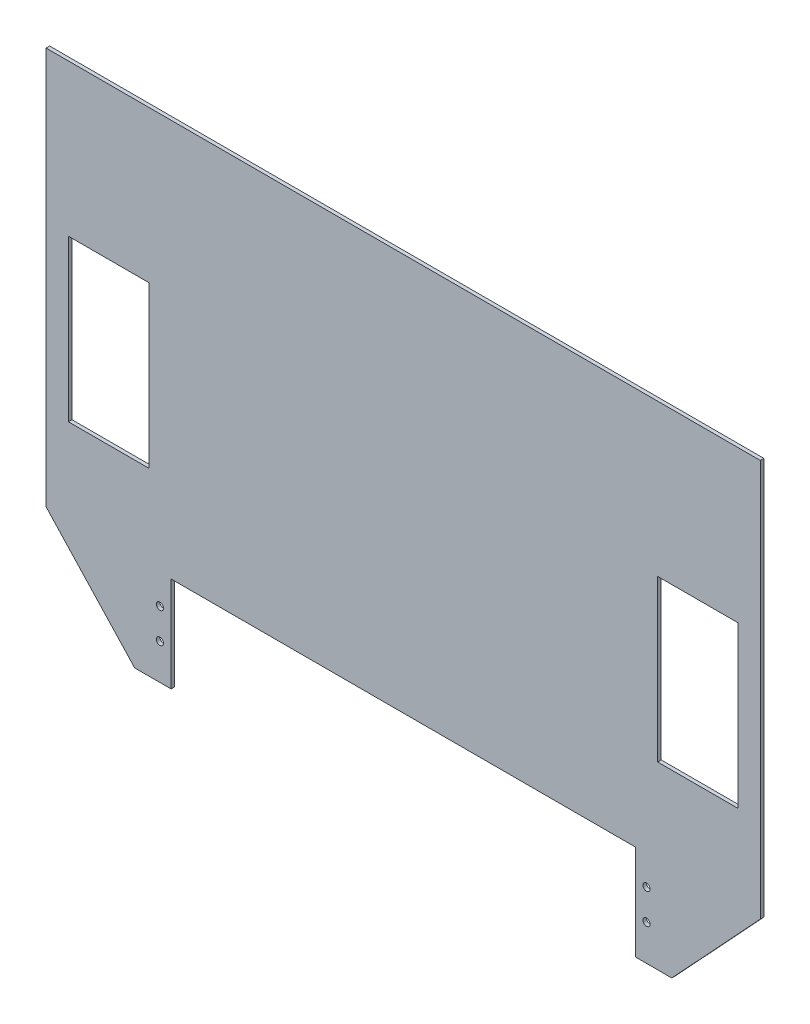
ISO-10303-21;
HEADER;
FILE_DESCRIPTION(('STEP AP214'),'2;1');
FILE_NAME('part.step','',(''),(''),'','','');
FILE_SCHEMA(('AUTOMOTIVE_DESIGN { 1 0 10303 214 1 1 1 1 }'));
ENDSEC;
DATA;
#1=APPLICATION_CONTEXT('core data for automotive mechanical design processes');
#2=APPLICATION_PROTOCOL_DEFINITION('international standard','automotive_design',2000,#1);
#3=PRODUCT_CONTEXT('',#1,'mechanical');
#4=PRODUCT('Part','Part','',(#3));
#5=PRODUCT_RELATED_PRODUCT_CATEGORY('part','',(#4));
#6=PRODUCT_DEFINITION_FORMATION('','',#4);
#7=PRODUCT_DEFINITION_CONTEXT('part definition',#1,'design');
#8=PRODUCT_DEFINITION('design','',#6,#7);
#9=PRODUCT_DEFINITION_SHAPE('','',#8);
#10=(LENGTH_UNIT() NAMED_UNIT(*) SI_UNIT(.MILLI.,.METRE.));
#11=(NAMED_UNIT(*) PLANE_ANGLE_UNIT() SI_UNIT($,.RADIAN.));
#12=(NAMED_UNIT(*) SI_UNIT($,.STERADIAN.) SOLID_ANGLE_UNIT());
#13=UNCERTAINTY_MEASURE_WITH_UNIT(LENGTH_MEASURE(1.E-05),#10,'distance_accuracy_value','');
#14=(GEOMETRIC_REPRESENTATION_CONTEXT(3) GLOBAL_UNCERTAINTY_ASSIGNED_CONTEXT((#13)) GLOBAL_UNIT_ASSIGNED_CONTEXT((#10,
#11,#12)) REPRESENTATION_CONTEXT('',''));
#15=CARTESIAN_POINT('',(0.,0.,0.));
#16=DIRECTION('',(0.,0.,1.));
#17=DIRECTION('',(1.,0.,0.));
#18=AXIS2_PLACEMENT_3D('',#15,#16,#17);
#19=CARTESIAN_POINT('',(0.,0.,2.));
#20=DIRECTION('',(0.,0.,-1.));
#21=DIRECTION('',(-1.,0.,0.));
#22=AXIS2_PLACEMENT_3D('',#19,#20,#21);
#23=PLANE('',#22);
#24=CARTESIAN_POINT('',(136.25,-238.82,2.));
#25=DIRECTION('',(0.,0.,1.));
#26=DIRECTION('',(-1.,0.,0.));
#27=AXIS2_PLACEMENT_3D('',#24,#25,#26);
#28=CIRCLE('',#27,2.);
#29=CARTESIAN_POINT('',(134.25,-238.82,2.));
#30=VERTEX_POINT('',#29);
#31=EDGE_CURVE('E531',#30,#30,#28,.T.);
#32=ORIENTED_EDGE('',*,*,#31,.F.);
#33=EDGE_LOOP('',(#32));
#34=FACE_BOUND('',#33,.T.);
#35=CARTESIAN_POINT('',(136.25,-255.82,2.));
#36=DIRECTION('',(0.,0.,1.));
#37=DIRECTION('',(-1.,0.,0.));
#38=AXIS2_PLACEMENT_3D('',#35,#36,#37);
#39=CIRCLE('',#38,2.);
#40=CARTESIAN_POINT('',(134.25,-255.82,2.));
#41=VERTEX_POINT('',#40);
#42=EDGE_CURVE('E528',#41,#41,#39,.T.);
#43=ORIENTED_EDGE('',*,*,#42,.F.);
#44=EDGE_LOOP('',(#43));
#45=FACE_BOUND('',#44,.T.);
#46=CARTESIAN_POINT('',(-136.25,-255.82,2.));
#47=DIRECTION('',(0.,0.,1.));
#48=DIRECTION('',(1.,0.,0.));
#49=AXIS2_PLACEMENT_3D('',#46,#47,#48);
#50=CIRCLE('',#49,2.);
#51=CARTESIAN_POINT('',(-134.25,-255.82,2.));
#52=VERTEX_POINT('',#51);
#53=EDGE_CURVE('E530',#52,#52,#50,.T.);
#54=ORIENTED_EDGE('',*,*,#53,.F.);
#55=EDGE_LOOP('',(#54));
#56=FACE_BOUND('',#55,.T.);
#57=CARTESIAN_POINT('',(-136.25,-238.82,2.));
#58=DIRECTION('',(0.,0.,1.));
#59=DIRECTION('',(1.,0.,0.));
#60=AXIS2_PLACEMENT_3D('',#57,#58,#59);
#61=CIRCLE('',#60,2.);
#62=CARTESIAN_POINT('',(-134.25,-238.82,2.));
#63=VERTEX_POINT('',#62);
#64=EDGE_CURVE('E360',#63,#63,#61,.T.);
#65=ORIENTED_EDGE('',*,*,#64,.F.);
#66=EDGE_LOOP('',(#65));
#67=FACE_BOUND('',#66,.T.);
#68=DIRECTION('',(0.,1.,0.));
#69=VECTOR('',#68,1.);
#70=CARTESIAN_POINT('',(-142.5,-85.,2.));
#71=LINE('',#70,#69);
#72=CARTESIAN_POINT('',(-142.5,-175.,2.));
#73=VERTEX_POINT('',#72);
#74=CARTESIAN_POINT('',(-142.5,-85.,2.));
#75=VERTEX_POINT('',#74);
#76=EDGE_CURVE('E216',#73,#75,#71,.T.);
#77=ORIENTED_EDGE('',*,*,#76,.F.);
#78=DIRECTION('',(1.,0.,0.));
#79=VECTOR('',#78,1.);
#80=CARTESIAN_POINT('',(-187.5,-175.,2.));
#81=LINE('',#80,#79);
#82=CARTESIAN_POINT('',(-187.5,-175.,2.));
#83=VERTEX_POINT('',#82);
#84=EDGE_CURVE('E227',#83,#73,#81,.T.);
#85=ORIENTED_EDGE('',*,*,#84,.F.);
#86=DIRECTION('',(0.,-1.,0.));
#87=VECTOR('',#86,1.);
#88=CARTESIAN_POINT('',(-187.5,-85.,2.));
#89=LINE('',#88,#87);
#90=CARTESIAN_POINT('',(-187.5,-85.,2.));
#91=VERTEX_POINT('',#90);
#92=EDGE_CURVE('E223',#91,#83,#89,.T.);
#93=ORIENTED_EDGE('',*,*,#92,.F.);
#94=DIRECTION('',(-1.,0.,0.));
#95=VECTOR('',#94,1.);
#96=CARTESIAN_POINT('',(-187.5,-85.,2.));
#97=LINE('',#96,#95);
#98=EDGE_CURVE('E219',#75,#91,#97,.T.);
#99=ORIENTED_EDGE('',*,*,#98,.F.);
#100=EDGE_LOOP('',(#77,#85,#93,#99));
#101=FACE_BOUND('',#100,.T.);
#102=DIRECTION('',(0.,-1.,0.));
#103=VECTOR('',#102,1.);
#104=CARTESIAN_POINT('',(130.,-275.82,2.));
#105=LINE('',#104,#103);
#106=CARTESIAN_POINT('',(130.,-222.5,2.));
#107=VERTEX_POINT('',#106);
#108=CARTESIAN_POINT('',(130.,-275.82,2.));
#109=VERTEX_POINT('',#108);
#110=EDGE_CURVE('E259',#107,#109,#105,.T.);
#111=ORIENTED_EDGE('',*,*,#110,.T.);
#112=DIRECTION('',(1.,0.,0.));
#113=VECTOR('',#112,1.);
#114=CARTESIAN_POINT('',(150.404334866845,-275.82,2.));
#115=LINE('',#114,#113);
#116=CARTESIAN_POINT('',(150.404334866845,-275.82,2.));
#117=VERTEX_POINT('',#116);
#118=EDGE_CURVE('E263',#109,#117,#115,.T.);
#119=ORIENTED_EDGE('',*,*,#118,.T.);
#120=DIRECTION('',(0.681072028744227,0.732216424059324,0.));
#121=VECTOR('',#120,1.);
#122=CARTESIAN_POINT('',(200.,-222.5,2.));
#123=LINE('',#122,#121);
#124=CARTESIAN_POINT('',(200.,-222.5,2.));
#125=VERTEX_POINT('',#124);
#126=EDGE_CURVE('E267',#117,#125,#123,.T.);
#127=ORIENTED_EDGE('',*,*,#126,.T.);
#128=DIRECTION('',(0.,1.,0.));
#129=VECTOR('',#128,1.);
#130=CARTESIAN_POINT('',(200.,0.,2.));
#131=LINE('',#130,#129);
#132=CARTESIAN_POINT('',(200.,0.,2.));
#133=VERTEX_POINT('',#132);
#134=EDGE_CURVE('E270',#125,#133,#131,.T.);
#135=ORIENTED_EDGE('',*,*,#134,.T.);
#136=DIRECTION('',(-1.,0.,0.));
#137=VECTOR('',#136,1.);
#138=CARTESIAN_POINT('',(200.,0.,2.));
#139=LINE('',#138,#137);
#140=CARTESIAN_POINT('',(-200.,0.,2.));
#141=VERTEX_POINT('',#140);
#142=EDGE_CURVE('E273',#133,#141,#139,.T.);
#143=ORIENTED_EDGE('',*,*,#142,.T.);
#144=DIRECTION('',(0.,-1.,0.));
#145=VECTOR('',#144,1.);
#146=CARTESIAN_POINT('',(-200.,0.,2.));
#147=LINE('',#146,#145);
#148=CARTESIAN_POINT('',(-200.,-222.5,2.));
#149=VERTEX_POINT('',#148);
#150=EDGE_CURVE('E276',#141,#149,#147,.T.);
#151=ORIENTED_EDGE('',*,*,#150,.T.);
#152=DIRECTION('',(0.681072028744227,-0.732216424059324,0.));
#153=VECTOR('',#152,1.);
#154=CARTESIAN_POINT('',(-200.,-222.5,2.));
#155=LINE('',#154,#153);
#156=CARTESIAN_POINT('',(-150.404334866845,-275.82,2.));
#157=VERTEX_POINT('',#156);
#158=EDGE_CURVE('E279',#149,#157,#155,.T.);
#159=ORIENTED_EDGE('',*,*,#158,.T.);
#160=DIRECTION('',(1.,0.,0.));
#161=VECTOR('',#160,1.);
#162=CARTESIAN_POINT('',(-150.404334866845,-275.82,2.));
#163=LINE('',#162,#161);
#164=CARTESIAN_POINT('',(-130.,-275.82,2.));
#165=VERTEX_POINT('',#164);
#166=EDGE_CURVE('E282',#157,#165,#163,.T.);
#167=ORIENTED_EDGE('',*,*,#166,.T.);
#168=DIRECTION('',(0.,1.,0.));
#169=VECTOR('',#168,1.);
#170=CARTESIAN_POINT('',(-130.,-275.82,2.));
#171=LINE('',#170,#169);
#172=CARTESIAN_POINT('',(-130.,-222.5,2.));
#173=VERTEX_POINT('',#172);
#174=EDGE_CURVE('E285',#165,#173,#171,.T.);
#175=ORIENTED_EDGE('',*,*,#174,.T.);
#176=DIRECTION('',(1.,0.,0.));
#177=VECTOR('',#176,1.);
#178=CARTESIAN_POINT('',(-130.,-222.5,2.));
#179=LINE('',#178,#177);
#180=EDGE_CURVE('E288',#173,#107,#179,.T.);
#181=ORIENTED_EDGE('',*,*,#180,.T.);
#182=EDGE_LOOP('',(#111,#119,#127,#135,#143,#151,#159,#167,#175,#181));
#183=FACE_BOUND('',#182,.T.);
#184=DIRECTION('',(-1.,0.,0.));
#185=VECTOR('',#184,1.);
#186=CARTESIAN_POINT('',(187.5,-84.9999999999999,2.));
#187=LINE('',#186,#185);
#188=CARTESIAN_POINT('',(187.5,-84.9999999999999,2.));
#189=VERTEX_POINT('',#188);
#190=CARTESIAN_POINT('',(142.5,-85.,2.));
#191=VERTEX_POINT('',#190);
#192=EDGE_CURVE('E167',#189,#191,#187,.T.);
#193=ORIENTED_EDGE('',*,*,#192,.F.);
#194=DIRECTION('',(0.,1.,0.));
#195=VECTOR('',#194,1.);
#196=CARTESIAN_POINT('',(187.5,-84.9999999999999,2.));
#197=LINE('',#196,#195);
#198=CARTESIAN_POINT('',(187.5,-175.,2.));
#199=VERTEX_POINT('',#198);
#200=EDGE_CURVE('E193',#199,#189,#197,.T.);
#201=ORIENTED_EDGE('',*,*,#200,.F.);
#202=DIRECTION('',(1.,0.,0.));
#203=VECTOR('',#202,1.);
#204=CARTESIAN_POINT('',(187.5,-175.,2.));
#205=LINE('',#204,#203);
#206=CARTESIAN_POINT('',(142.5,-175.,2.));
#207=VERTEX_POINT('',#206);
#208=EDGE_CURVE('E189',#207,#199,#205,.T.);
#209=ORIENTED_EDGE('',*,*,#208,.F.);
#210=DIRECTION('',(0.,-1.,0.));
#211=VECTOR('',#210,1.);
#212=CARTESIAN_POINT('',(142.5,-85.,2.));
#213=LINE('',#212,#211);
#214=EDGE_CURVE('E176',#191,#207,#213,.T.);
#215=ORIENTED_EDGE('',*,*,#214,.F.);
#216=EDGE_LOOP('',(#193,#201,#209,#215));
#217=FACE_BOUND('',#216,.T.);
#218=ADVANCED_FACE('F39',(#34,#45,#56,#67,#101,#183,#217),#23,.F.);
#219=CARTESIAN_POINT('',(0.,0.,0.));
#220=DIRECTION('',(0.,0.,-1.));
#221=DIRECTION('',(-1.,0.,0.));
#222=AXIS2_PLACEMENT_3D('',#219,#220,#221);
#223=PLANE('',#222);
#224=CARTESIAN_POINT('',(136.25,-238.82,0.));
#225=DIRECTION('',(0.,0.,-1.));
#226=DIRECTION('',(-1.,0.,0.));
#227=AXIS2_PLACEMENT_3D('',#224,#225,#226);
#228=CIRCLE('',#227,2.);
#229=CARTESIAN_POINT('',(134.25,-238.82,0.));
#230=VERTEX_POINT('',#229);
#231=EDGE_CURVE('E43',#230,#230,#228,.T.);
#232=ORIENTED_EDGE('',*,*,#231,.F.);
#233=EDGE_LOOP('',(#232));
#234=FACE_BOUND('',#233,.T.);
#235=CARTESIAN_POINT('',(136.25,-255.82,0.));
#236=DIRECTION('',(0.,0.,-1.));
#237=DIRECTION('',(-1.,0.,0.));
#238=AXIS2_PLACEMENT_3D('',#235,#236,#237);
#239=CIRCLE('',#238,2.);
#240=CARTESIAN_POINT('',(134.25,-255.82,0.));
#241=VERTEX_POINT('',#240);
#242=EDGE_CURVE('E363',#241,#241,#239,.T.);
#243=ORIENTED_EDGE('',*,*,#242,.F.);
#244=EDGE_LOOP('',(#243));
#245=FACE_BOUND('',#244,.T.);
#246=CARTESIAN_POINT('',(-136.25,-255.82,0.));
#247=DIRECTION('',(0.,0.,-1.));
#248=DIRECTION('',(-1.,0.,0.));
#249=AXIS2_PLACEMENT_3D('',#246,#247,#248);
#250=CIRCLE('',#249,2.);
#251=CARTESIAN_POINT('',(-138.25,-255.82,0.));
#252=VERTEX_POINT('',#251);
#253=EDGE_CURVE('E359',#252,#252,#250,.T.);
#254=ORIENTED_EDGE('',*,*,#253,.F.);
#255=EDGE_LOOP('',(#254));
#256=FACE_BOUND('',#255,.T.);
#257=CARTESIAN_POINT('',(-136.25,-238.82,0.));
#258=DIRECTION('',(0.,0.,-1.));
#259=DIRECTION('',(-1.,0.,0.));
#260=AXIS2_PLACEMENT_3D('',#257,#258,#259);
#261=CIRCLE('',#260,2.);
#262=CARTESIAN_POINT('',(-138.25,-238.82,0.));
#263=VERTEX_POINT('',#262);
#264=EDGE_CURVE('E355',#263,#263,#261,.T.);
#265=ORIENTED_EDGE('',*,*,#264,.F.);
#266=EDGE_LOOP('',(#265));
#267=FACE_BOUND('',#266,.T.);
#268=DIRECTION('',(0.,-1.,0.));
#269=VECTOR('',#268,1.);
#270=CARTESIAN_POINT('',(130.,-275.82,0.));
#271=LINE('',#270,#269);
#272=CARTESIAN_POINT('',(130.,-222.5,0.));
#273=VERTEX_POINT('',#272);
#274=CARTESIAN_POINT('',(130.,-275.82,0.));
#275=VERTEX_POINT('',#274);
#276=EDGE_CURVE('E258',#273,#275,#271,.T.);
#277=ORIENTED_EDGE('',*,*,#276,.F.);
#278=DIRECTION('',(1.,0.,0.));
#279=VECTOR('',#278,1.);
#280=CARTESIAN_POINT('',(-130.,-222.5,0.));
#281=LINE('',#280,#279);
#282=CARTESIAN_POINT('',(-130.,-222.5,0.));
#283=VERTEX_POINT('',#282);
#284=EDGE_CURVE('E264',#283,#273,#281,.T.);
#285=ORIENTED_EDGE('',*,*,#284,.F.);
#286=DIRECTION('',(0.,1.,0.));
#287=VECTOR('',#286,1.);
#288=CARTESIAN_POINT('',(-130.,-275.82,0.));
#289=LINE('',#288,#287);
#290=CARTESIAN_POINT('',(-130.,-275.82,0.));
#291=VERTEX_POINT('',#290);
#292=EDGE_CURVE('E316',#291,#283,#289,.T.);
#293=ORIENTED_EDGE('',*,*,#292,.F.);
#294=DIRECTION('',(1.,0.,0.));
#295=VECTOR('',#294,1.);
#296=CARTESIAN_POINT('',(-150.404334866845,-275.82,0.));
#297=LINE('',#296,#295);
#298=CARTESIAN_POINT('',(-150.404334866845,-275.82,0.));
#299=VERTEX_POINT('',#298);
#300=EDGE_CURVE('E313',#299,#291,#297,.T.);
#301=ORIENTED_EDGE('',*,*,#300,.F.);
#302=DIRECTION('',(0.681072028744227,-0.732216424059324,0.));
#303=VECTOR('',#302,1.);
#304=CARTESIAN_POINT('',(-200.,-222.5,0.));
#305=LINE('',#304,#303);
#306=CARTESIAN_POINT('',(-200.,-222.5,0.));
#307=VERTEX_POINT('',#306);
#308=EDGE_CURVE('E310',#307,#299,#305,.T.);
#309=ORIENTED_EDGE('',*,*,#308,.F.);
#310=DIRECTION('',(0.,-1.,0.));
#311=VECTOR('',#310,1.);
#312=CARTESIAN_POINT('',(-200.,0.,0.));
#313=LINE('',#312,#311);
#314=CARTESIAN_POINT('',(-200.,0.,0.));
#315=VERTEX_POINT('',#314);
#316=EDGE_CURVE('E307',#315,#307,#313,.T.);
#317=ORIENTED_EDGE('',*,*,#316,.F.);
#318=DIRECTION('',(-1.,0.,0.));
#319=VECTOR('',#318,1.);
#320=CARTESIAN_POINT('',(200.,0.,0.));
#321=LINE('',#320,#319);
#322=CARTESIAN_POINT('',(200.,0.,0.));
#323=VERTEX_POINT('',#322);
#324=EDGE_CURVE('E304',#323,#315,#321,.T.);
#325=ORIENTED_EDGE('',*,*,#324,.F.);
#326=DIRECTION('',(0.,1.,0.));
#327=VECTOR('',#326,1.);
#328=CARTESIAN_POINT('',(200.,0.,0.));
#329=LINE('',#328,#327);
#330=CARTESIAN_POINT('',(200.,-222.5,0.));
#331=VERTEX_POINT('',#330);
#332=EDGE_CURVE('E301',#331,#323,#329,.T.);
#333=ORIENTED_EDGE('',*,*,#332,.F.);
#334=DIRECTION('',(0.681072028744227,0.732216424059324,0.));
#335=VECTOR('',#334,1.);
#336=CARTESIAN_POINT('',(200.,-222.5,0.));
#337=LINE('',#336,#335);
#338=CARTESIAN_POINT('',(150.404334866845,-275.82,0.));
#339=VERTEX_POINT('',#338);
#340=EDGE_CURVE('E298',#339,#331,#337,.T.);
#341=ORIENTED_EDGE('',*,*,#340,.F.);
#342=DIRECTION('',(1.,0.,0.));
#343=VECTOR('',#342,1.);
#344=CARTESIAN_POINT('',(150.404334866845,-275.82,0.));
#345=LINE('',#344,#343);
#346=EDGE_CURVE('E295',#275,#339,#345,.T.);
#347=ORIENTED_EDGE('',*,*,#346,.F.);
#348=EDGE_LOOP('',(#277,#285,#293,#301,#309,#317,#325,#333,#341,#347));
#349=FACE_BOUND('',#348,.T.);
#350=DIRECTION('',(1.,0.,0.));
#351=VECTOR('',#350,1.);
#352=CARTESIAN_POINT('',(-187.5,-175.,0.));
#353=LINE('',#352,#351);
#354=CARTESIAN_POINT('',(-187.5,-175.,0.));
#355=VERTEX_POINT('',#354);
#356=CARTESIAN_POINT('',(-142.5,-175.,0.));
#357=VERTEX_POINT('',#356);
#358=EDGE_CURVE('E220',#355,#357,#353,.T.);
#359=ORIENTED_EDGE('',*,*,#358,.T.);
#360=DIRECTION('',(0.,1.,0.));
#361=VECTOR('',#360,1.);
#362=CARTESIAN_POINT('',(-142.5,-85.,0.));
#363=LINE('',#362,#361);
#364=CARTESIAN_POINT('',(-142.5,-85.,0.));
#365=VERTEX_POINT('',#364);
#366=EDGE_CURVE('E185',#357,#365,#363,.T.);
#367=ORIENTED_EDGE('',*,*,#366,.T.);
#368=DIRECTION('',(-1.,0.,0.));
#369=VECTOR('',#368,1.);
#370=CARTESIAN_POINT('',(-187.5,-85.,0.));
#371=LINE('',#370,#369);
#372=CARTESIAN_POINT('',(-187.5,-85.,0.));
#373=VERTEX_POINT('',#372);
#374=EDGE_CURVE('E234',#365,#373,#371,.T.);
#375=ORIENTED_EDGE('',*,*,#374,.T.);
#376=DIRECTION('',(0.,-1.,0.));
#377=VECTOR('',#376,1.);
#378=CARTESIAN_POINT('',(-187.5,-85.,0.));
#379=LINE('',#378,#377);
#380=EDGE_CURVE('E238',#373,#355,#379,.T.);
#381=ORIENTED_EDGE('',*,*,#380,.T.);
#382=EDGE_LOOP('',(#359,#367,#375,#381));
#383=FACE_BOUND('',#382,.T.);
#384=DIRECTION('',(0.,1.,0.));
#385=VECTOR('',#384,1.);
#386=CARTESIAN_POINT('',(187.5,-84.9999999999999,0.));
#387=LINE('',#386,#385);
#388=CARTESIAN_POINT('',(187.5,-175.,0.));
#389=VERTEX_POINT('',#388);
#390=CARTESIAN_POINT('',(187.5,-84.9999999999999,0.));
#391=VERTEX_POINT('',#390);
#392=EDGE_CURVE('E177',#389,#391,#387,.T.);
#393=ORIENTED_EDGE('',*,*,#392,.T.);
#394=DIRECTION('',(-1.,0.,0.));
#395=VECTOR('',#394,1.);
#396=CARTESIAN_POINT('',(187.5,-84.9999999999999,0.));
#397=LINE('',#396,#395);
#398=CARTESIAN_POINT('',(142.5,-85.,0.));
#399=VERTEX_POINT('',#398);
#400=EDGE_CURVE('E65',#391,#399,#397,.T.);
#401=ORIENTED_EDGE('',*,*,#400,.T.);
#402=DIRECTION('',(0.,-1.,0.));
#403=VECTOR('',#402,1.);
#404=CARTESIAN_POINT('',(142.5,-85.,0.));
#405=LINE('',#404,#403);
#406=CARTESIAN_POINT('',(142.5,-175.,0.));
#407=VERTEX_POINT('',#406);
#408=EDGE_CURVE('E183',#399,#407,#405,.T.);
#409=ORIENTED_EDGE('',*,*,#408,.T.);
#410=DIRECTION('',(1.,0.,0.));
#411=VECTOR('',#410,1.);
#412=CARTESIAN_POINT('',(187.5,-175.,0.));
#413=LINE('',#412,#411);
#414=EDGE_CURVE('E203',#407,#389,#413,.T.);
#415=ORIENTED_EDGE('',*,*,#414,.T.);
#416=EDGE_LOOP('',(#393,#401,#409,#415));
#417=FACE_BOUND('',#416,.T.);
#418=ADVANCED_FACE('F375',(#234,#245,#256,#267,#349,#383,#417),#223,.T.);
#419=CARTESIAN_POINT('',(130.,-275.82,2.));
#420=DIRECTION('',(1.,0.,0.));
#421=DIRECTION('',(0.,1.,0.));
#422=AXIS2_PLACEMENT_3D('',#419,#420,#421);
#423=PLANE('',#422);
#424=ORIENTED_EDGE('',*,*,#276,.T.);
#425=DIRECTION('',(0.,0.,-1.));
#426=VECTOR('',#425,1.);
#427=CARTESIAN_POINT('',(130.,-275.82,2.));
#428=LINE('',#427,#426);
#429=EDGE_CURVE('E11',#109,#275,#428,.T.);
#430=ORIENTED_EDGE('',*,*,#429,.F.);
#431=ORIENTED_EDGE('',*,*,#110,.F.);
#432=DIRECTION('',(0.,0.,-1.));
#433=VECTOR('',#432,1.);
#434=CARTESIAN_POINT('',(130.,-222.5,2.));
#435=LINE('',#434,#433);
#436=EDGE_CURVE('E291',#107,#273,#435,.T.);
#437=ORIENTED_EDGE('',*,*,#436,.T.);
#438=EDGE_LOOP('',(#424,#430,#431,#437));
#439=FACE_BOUND('',#438,.T.);
#440=ADVANCED_FACE('F41',(#439),#423,.F.);
#441=CARTESIAN_POINT('',(150.404334866845,-275.82,2.));
#442=DIRECTION('',(0.,1.,0.));
#443=DIRECTION('',(0.,0.,1.));
#444=AXIS2_PLACEMENT_3D('',#441,#442,#443);
#445=PLANE('',#444);
#446=ORIENTED_EDGE('',*,*,#346,.T.);
#447=DIRECTION('',(0.,0.,-1.));
#448=VECTOR('',#447,1.);
#449=CARTESIAN_POINT('',(150.404334866845,-275.82,2.));
#450=LINE('',#449,#448);
#451=EDGE_CURVE('E49',#117,#339,#450,.T.);
#452=ORIENTED_EDGE('',*,*,#451,.F.);
#453=ORIENTED_EDGE('',*,*,#118,.F.);
#454=ORIENTED_EDGE('',*,*,#429,.T.);
#455=EDGE_LOOP('',(#446,#452,#453,#454));
#456=FACE_BOUND('',#455,.T.);
#457=ADVANCED_FACE('F445',(#456),#445,.F.);
#458=CARTESIAN_POINT('',(200.,-222.5,2.));
#459=DIRECTION('',(-0.732216424059324,0.681072028744227,0.));
#460=DIRECTION('',(-0.681072028744227,-0.732216424059324,0.));
#461=AXIS2_PLACEMENT_3D('',#458,#459,#460);
#462=PLANE('',#461);
#463=ORIENTED_EDGE('',*,*,#340,.T.);
#464=DIRECTION('',(0.,0.,-1.));
#465=VECTOR('',#464,1.);
#466=CARTESIAN_POINT('',(200.,-222.5,2.));
#467=LINE('',#466,#465);
#468=EDGE_CURVE('E348',#125,#331,#467,.T.);
#469=ORIENTED_EDGE('',*,*,#468,.F.);
#470=ORIENTED_EDGE('',*,*,#126,.F.);
#471=ORIENTED_EDGE('',*,*,#451,.T.);
#472=EDGE_LOOP('',(#463,#469,#470,#471));
#473=FACE_BOUND('',#472,.T.);
#474=ADVANCED_FACE('F442',(#473),#462,.F.);
#475=CARTESIAN_POINT('',(200.,0.,2.));
#476=DIRECTION('',(-1.,0.,0.));
#477=DIRECTION('',(0.,-1.,0.));
#478=AXIS2_PLACEMENT_3D('',#475,#476,#477);
#479=PLANE('',#478);
#480=ORIENTED_EDGE('',*,*,#332,.T.);
#481=DIRECTION('',(0.,0.,-1.));
#482=VECTOR('',#481,1.);
#483=CARTESIAN_POINT('',(200.,0.,2.));
#484=LINE('',#483,#482);
#485=EDGE_CURVE('E344',#133,#323,#484,.T.);
#486=ORIENTED_EDGE('',*,*,#485,.F.);
#487=ORIENTED_EDGE('',*,*,#134,.F.);
#488=ORIENTED_EDGE('',*,*,#468,.T.);
#489=EDGE_LOOP('',(#480,#486,#487,#488));
#490=FACE_BOUND('',#489,.T.);
#491=ADVANCED_FACE('F438',(#490),#479,.F.);
#492=CARTESIAN_POINT('',(200.,0.,2.));
#493=DIRECTION('',(0.,-1.,0.));
#494=DIRECTION('',(1.,0.,0.));
#495=AXIS2_PLACEMENT_3D('',#492,#493,#494);
#496=PLANE('',#495);
#497=ORIENTED_EDGE('',*,*,#324,.T.);
#498=DIRECTION('',(0.,0.,-1.));
#499=VECTOR('',#498,1.);
#500=CARTESIAN_POINT('',(-200.,0.,2.));
#501=LINE('',#500,#499);
#502=EDGE_CURVE('E340',#141,#315,#501,.T.);
#503=ORIENTED_EDGE('',*,*,#502,.F.);
#504=ORIENTED_EDGE('',*,*,#142,.F.);
#505=ORIENTED_EDGE('',*,*,#485,.T.);
#506=EDGE_LOOP('',(#497,#503,#504,#505));
#507=FACE_BOUND('',#506,.T.);
#508=ADVANCED_FACE('F434',(#507),#496,.F.);
#509=CARTESIAN_POINT('',(-200.,0.,2.));
#510=DIRECTION('',(1.,0.,0.));
#511=DIRECTION('',(0.,0.,-1.));
#512=AXIS2_PLACEMENT_3D('',#509,#510,#511);
#513=PLANE('',#512);
#514=ORIENTED_EDGE('',*,*,#316,.T.);
#515=DIRECTION('',(0.,0.,-1.));
#516=VECTOR('',#515,1.);
#517=CARTESIAN_POINT('',(-200.,-222.5,2.));
#518=LINE('',#517,#516);
#519=EDGE_CURVE('E336',#149,#307,#518,.T.);
#520=ORIENTED_EDGE('',*,*,#519,.F.);
#521=ORIENTED_EDGE('',*,*,#150,.F.);
#522=ORIENTED_EDGE('',*,*,#502,.T.);
#523=EDGE_LOOP('',(#514,#520,#521,#522));
#524=FACE_BOUND('',#523,.T.);
#525=ADVANCED_FACE('F430',(#524),#513,.F.);
#526=CARTESIAN_POINT('',(-200.,-222.5,2.));
#527=DIRECTION('',(0.732216424059324,0.681072028744227,0.));
#528=DIRECTION('',(-0.681072028744227,0.732216424059324,0.));
#529=AXIS2_PLACEMENT_3D('',#526,#527,#528);
#530=PLANE('',#529);
#531=ORIENTED_EDGE('',*,*,#308,.T.);
#532=DIRECTION('',(0.,0.,-1.));
#533=VECTOR('',#532,1.);
#534=CARTESIAN_POINT('',(-150.404334866845,-275.82,2.));
#535=LINE('',#534,#533);
#536=EDGE_CURVE('E332',#157,#299,#535,.T.);
#537=ORIENTED_EDGE('',*,*,#536,.F.);
#538=ORIENTED_EDGE('',*,*,#158,.F.);
#539=ORIENTED_EDGE('',*,*,#519,.T.);
#540=EDGE_LOOP('',(#531,#537,#538,#539));
#541=FACE_BOUND('',#540,.T.);
#542=ADVANCED_FACE('F426',(#541),#530,.F.);
#543=CARTESIAN_POINT('',(-150.404334866845,-275.82,2.));
#544=DIRECTION('',(0.,1.,0.));
#545=DIRECTION('',(0.,0.,1.));
#546=AXIS2_PLACEMENT_3D('',#543,#544,#545);
#547=PLANE('',#546);
#548=ORIENTED_EDGE('',*,*,#300,.T.);
#549=DIRECTION('',(0.,0.,-1.));
#550=VECTOR('',#549,1.);
#551=CARTESIAN_POINT('',(-130.,-275.82,2.));
#552=LINE('',#551,#550);
#553=EDGE_CURVE('E328',#165,#291,#552,.T.);
#554=ORIENTED_EDGE('',*,*,#553,.F.);
#555=ORIENTED_EDGE('',*,*,#166,.F.);
#556=ORIENTED_EDGE('',*,*,#536,.T.);
#557=EDGE_LOOP('',(#548,#554,#555,#556));
#558=FACE_BOUND('',#557,.T.);
#559=ADVANCED_FACE('F422',(#558),#547,.F.);
#560=CARTESIAN_POINT('',(-130.,-275.82,2.));
#561=DIRECTION('',(-1.,0.,0.));
#562=DIRECTION('',(0.,-1.,0.));
#563=AXIS2_PLACEMENT_3D('',#560,#561,#562);
#564=PLANE('',#563);
#565=ORIENTED_EDGE('',*,*,#292,.T.);
#566=DIRECTION('',(0.,0.,-1.));
#567=VECTOR('',#566,1.);
#568=CARTESIAN_POINT('',(-130.,-222.5,2.));
#569=LINE('',#568,#567);
#570=EDGE_CURVE('E324',#173,#283,#569,.T.);
#571=ORIENTED_EDGE('',*,*,#570,.F.);
#572=ORIENTED_EDGE('',*,*,#174,.F.);
#573=ORIENTED_EDGE('',*,*,#553,.T.);
#574=EDGE_LOOP('',(#565,#571,#572,#573));
#575=FACE_BOUND('',#574,.T.);
#576=ADVANCED_FACE('F418',(#575),#564,.F.);
#577=CARTESIAN_POINT('',(-130.,-222.5,2.));
#578=DIRECTION('',(0.,1.,0.));
#579=DIRECTION('',(-1.,0.,0.));
#580=AXIS2_PLACEMENT_3D('',#577,#578,#579);
#581=PLANE('',#580);
#582=ORIENTED_EDGE('',*,*,#284,.T.);
#583=ORIENTED_EDGE('',*,*,#436,.F.);
#584=ORIENTED_EDGE('',*,*,#180,.F.);
#585=ORIENTED_EDGE('',*,*,#570,.T.);
#586=EDGE_LOOP('',(#582,#583,#584,#585));
#587=FACE_BOUND('',#586,.T.);
#588=ADVANCED_FACE('F415',(#587),#581,.F.);
#589=CARTESIAN_POINT('',(-142.5,-85.,2.));
#590=DIRECTION('',(-1.,0.,0.));
#591=DIRECTION('',(0.,-1.,0.));
#592=AXIS2_PLACEMENT_3D('',#589,#590,#591);
#593=PLANE('',#592);
#594=ORIENTED_EDGE('',*,*,#366,.F.);
#595=DIRECTION('',(0.,0.,-1.));
#596=VECTOR('',#595,1.);
#597=CARTESIAN_POINT('',(-142.5,-175.,2.));
#598=LINE('',#597,#596);
#599=EDGE_CURVE('E230',#73,#357,#598,.T.);
#600=ORIENTED_EDGE('',*,*,#599,.F.);
#601=ORIENTED_EDGE('',*,*,#76,.T.);
#602=DIRECTION('',(0.,0.,-1.));
#603=VECTOR('',#602,1.);
#604=CARTESIAN_POINT('',(-142.5,-85.,2.));
#605=LINE('',#604,#603);
#606=EDGE_CURVE('E254',#75,#365,#605,.T.);
#607=ORIENTED_EDGE('',*,*,#606,.T.);
#608=EDGE_LOOP('',(#594,#600,#601,#607));
#609=FACE_BOUND('',#608,.T.);
#610=ADVANCED_FACE('F412',(#609),#593,.T.);
#611=CARTESIAN_POINT('',(-187.5,-85.,2.));
#612=DIRECTION('',(0.,-1.,0.));
#613=DIRECTION('',(1.,0.,0.));
#614=AXIS2_PLACEMENT_3D('',#611,#612,#613);
#615=PLANE('',#614);
#616=ORIENTED_EDGE('',*,*,#374,.F.);
#617=ORIENTED_EDGE('',*,*,#606,.F.);
#618=ORIENTED_EDGE('',*,*,#98,.T.);
#619=DIRECTION('',(0.,0.,-1.));
#620=VECTOR('',#619,1.);
#621=CARTESIAN_POINT('',(-187.5,-85.,2.));
#622=LINE('',#621,#620);
#623=EDGE_CURVE('E251',#91,#373,#622,.T.);
#624=ORIENTED_EDGE('',*,*,#623,.T.);
#625=EDGE_LOOP('',(#616,#617,#618,#624));
#626=FACE_BOUND('',#625,.T.);
#627=ADVANCED_FACE('F553',(#626),#615,.T.);
#628=CARTESIAN_POINT('',(-187.5,-85.,2.));
#629=DIRECTION('',(1.,0.,0.));
#630=DIRECTION('',(0.,0.,-1.));
#631=AXIS2_PLACEMENT_3D('',#628,#629,#630);
#632=PLANE('',#631);
#633=ORIENTED_EDGE('',*,*,#380,.F.);
#634=ORIENTED_EDGE('',*,*,#623,.F.);
#635=ORIENTED_EDGE('',*,*,#92,.T.);
#636=DIRECTION('',(0.,0.,-1.));
#637=VECTOR('',#636,1.);
#638=CARTESIAN_POINT('',(-187.5,-175.,2.));
#639=LINE('',#638,#637);
#640=EDGE_CURVE('E248',#83,#355,#639,.T.);
#641=ORIENTED_EDGE('',*,*,#640,.T.);
#642=EDGE_LOOP('',(#633,#634,#635,#641));
#643=FACE_BOUND('',#642,.T.);
#644=ADVANCED_FACE('F559',(#643),#632,.T.);
#645=CARTESIAN_POINT('',(-187.5,-175.,2.));
#646=DIRECTION('',(0.,1.,0.));
#647=DIRECTION('',(0.,0.,1.));
#648=AXIS2_PLACEMENT_3D('',#645,#646,#647);
#649=PLANE('',#648);
#650=ORIENTED_EDGE('',*,*,#358,.F.);
#651=ORIENTED_EDGE('',*,*,#640,.F.);
#652=ORIENTED_EDGE('',*,*,#84,.T.);
#653=ORIENTED_EDGE('',*,*,#599,.T.);
#654=EDGE_LOOP('',(#650,#651,#652,#653));
#655=FACE_BOUND('',#654,.T.);
#656=ADVANCED_FACE('F557',(#655),#649,.T.);
#657=CARTESIAN_POINT('',(187.5,-84.9999999999999,2.));
#658=DIRECTION('',(0.,-1.,0.));
#659=DIRECTION('',(1.,0.,0.));
#660=AXIS2_PLACEMENT_3D('',#657,#658,#659);
#661=PLANE('',#660);
#662=ORIENTED_EDGE('',*,*,#400,.F.);
#663=DIRECTION('',(0.,0.,-1.));
#664=VECTOR('',#663,1.);
#665=CARTESIAN_POINT('',(187.5,-84.9999999999999,2.));
#666=LINE('',#665,#664);
#667=EDGE_CURVE('E171',#189,#391,#666,.T.);
#668=ORIENTED_EDGE('',*,*,#667,.F.);
#669=ORIENTED_EDGE('',*,*,#192,.T.);
#670=DIRECTION('',(0.,0.,-1.));
#671=VECTOR('',#670,1.);
#672=CARTESIAN_POINT('',(142.5,-85.,2.));
#673=LINE('',#672,#671);
#674=EDGE_CURVE('E170',#191,#399,#673,.T.);
#675=ORIENTED_EDGE('',*,*,#674,.T.);
#676=EDGE_LOOP('',(#662,#668,#669,#675));
#677=FACE_BOUND('',#676,.T.);
#678=ADVANCED_FACE('F169',(#677),#661,.T.);
#679=CARTESIAN_POINT('',(142.5,-85.,2.));
#680=DIRECTION('',(1.,0.,0.));
#681=DIRECTION('',(0.,0.,-1.));
#682=AXIS2_PLACEMENT_3D('',#679,#680,#681);
#683=PLANE('',#682);
#684=ORIENTED_EDGE('',*,*,#408,.F.);
#685=ORIENTED_EDGE('',*,*,#674,.F.);
#686=ORIENTED_EDGE('',*,*,#214,.T.);
#687=DIRECTION('',(0.,0.,-1.));
#688=VECTOR('',#687,1.);
#689=CARTESIAN_POINT('',(142.5,-175.,2.));
#690=LINE('',#689,#688);
#691=EDGE_CURVE('E186',#207,#407,#690,.T.);
#692=ORIENTED_EDGE('',*,*,#691,.T.);
#693=EDGE_LOOP('',(#684,#685,#686,#692));
#694=FACE_BOUND('',#693,.T.);
#695=ADVANCED_FACE('F180',(#694),#683,.T.);
#696=CARTESIAN_POINT('',(187.5,-175.,2.));
#697=DIRECTION('',(0.,1.,0.));
#698=DIRECTION('',(-1.,0.,0.));
#699=AXIS2_PLACEMENT_3D('',#696,#697,#698);
#700=PLANE('',#699);
#701=ORIENTED_EDGE('',*,*,#414,.F.);
#702=ORIENTED_EDGE('',*,*,#691,.F.);
#703=ORIENTED_EDGE('',*,*,#208,.T.);
#704=DIRECTION('',(0.,0.,-1.));
#705=VECTOR('',#704,1.);
#706=CARTESIAN_POINT('',(187.5,-175.,2.));
#707=LINE('',#706,#705);
#708=EDGE_CURVE('E57',#199,#389,#707,.T.);
#709=ORIENTED_EDGE('',*,*,#708,.T.);
#710=EDGE_LOOP('',(#701,#702,#703,#709));
#711=FACE_BOUND('',#710,.T.);
#712=ADVANCED_FACE('F393',(#711),#700,.T.);
#713=CARTESIAN_POINT('',(187.5,-84.9999999999999,2.));
#714=DIRECTION('',(-1.,0.,0.));
#715=DIRECTION('',(0.,-1.,0.));
#716=AXIS2_PLACEMENT_3D('',#713,#714,#715);
#717=PLANE('',#716);
#718=ORIENTED_EDGE('',*,*,#392,.F.);
#719=ORIENTED_EDGE('',*,*,#708,.F.);
#720=ORIENTED_EDGE('',*,*,#200,.T.);
#721=ORIENTED_EDGE('',*,*,#667,.T.);
#722=EDGE_LOOP('',(#718,#719,#720,#721));
#723=FACE_BOUND('',#722,.T.);
#724=ADVANCED_FACE('F390',(#723),#717,.T.);
#725=CARTESIAN_POINT('',(-136.25,-238.82,-8.));
#726=DIRECTION('',(0.,0.,1.));
#727=DIRECTION('',(1.,0.,0.));
#728=AXIS2_PLACEMENT_3D('',#725,#726,#727);
#729=CYLINDRICAL_SURFACE('',#728,2.);
#730=ORIENTED_EDGE('',*,*,#264,.T.);
#731=EDGE_LOOP('',(#730));
#732=FACE_BOUND('',#731,.T.);
#733=ORIENTED_EDGE('',*,*,#64,.T.);
#734=EDGE_LOOP('',(#733));
#735=FACE_BOUND('',#734,.T.);
#736=ADVANCED_FACE('F392',(#732,#735),#729,.F.);
#737=CARTESIAN_POINT('',(-136.25,-255.82,-8.));
#738=DIRECTION('',(0.,0.,1.));
#739=DIRECTION('',(1.,0.,0.));
#740=AXIS2_PLACEMENT_3D('',#737,#738,#739);
#741=CYLINDRICAL_SURFACE('',#740,2.);
#742=ORIENTED_EDGE('',*,*,#253,.T.);
#743=EDGE_LOOP('',(#742));
#744=FACE_BOUND('',#743,.T.);
#745=ORIENTED_EDGE('',*,*,#53,.T.);
#746=EDGE_LOOP('',(#745));
#747=FACE_BOUND('',#746,.T.);
#748=ADVANCED_FACE('F399',(#744,#747),#741,.F.);
#749=CARTESIAN_POINT('',(136.25,-255.82,-8.));
#750=DIRECTION('',(0.,0.,1.));
#751=DIRECTION('',(1.,0.,0.));
#752=AXIS2_PLACEMENT_3D('',#749,#750,#751);
#753=CYLINDRICAL_SURFACE('',#752,2.);
#754=ORIENTED_EDGE('',*,*,#242,.T.);
#755=EDGE_LOOP('',(#754));
#756=FACE_BOUND('',#755,.T.);
#757=ORIENTED_EDGE('',*,*,#42,.T.);
#758=EDGE_LOOP('',(#757));
#759=FACE_BOUND('',#758,.T.);
#760=ADVANCED_FACE('F504',(#756,#759),#753,.F.);
#761=CARTESIAN_POINT('',(136.25,-238.82,-8.));
#762=DIRECTION('',(0.,0.,1.));
#763=DIRECTION('',(1.,0.,0.));
#764=AXIS2_PLACEMENT_3D('',#761,#762,#763);
#765=CYLINDRICAL_SURFACE('',#764,2.);
#766=ORIENTED_EDGE('',*,*,#231,.T.);
#767=EDGE_LOOP('',(#766));
#768=FACE_BOUND('',#767,.T.);
#769=ORIENTED_EDGE('',*,*,#31,.T.);
#770=EDGE_LOOP('',(#769));
#771=FACE_BOUND('',#770,.T.);
#772=ADVANCED_FACE('F372',(#768,#771),#765,.F.);
#773=CLOSED_SHELL('',(#218,#418,#440,#457,#474,#491,#508,#525,#542,#559,#576,#588,#610,#627,
#644,#656,#678,#695,#712,#724,#736,#748,#760,#772));
#774=MANIFOLD_SOLID_BREP('B2',#773);
#775=ADVANCED_BREP_SHAPE_REPRESENTATION('',(#18,#774),#14);
#776=SHAPE_DEFINITION_REPRESENTATION(#9,#775);
ENDSEC;
END-ISO-10303-21;
